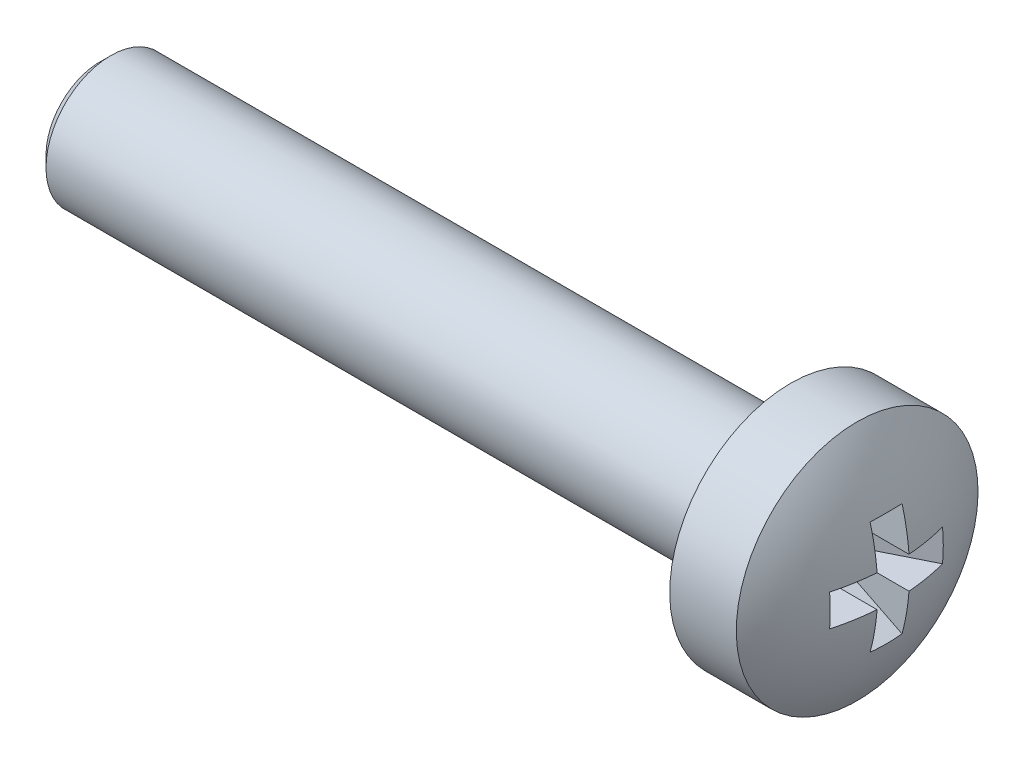
ISO-10303-21;
HEADER;
FILE_DESCRIPTION(('STEP AP214'),'2;1');
FILE_NAME('part.step','',(''),(''),'','','');
FILE_SCHEMA(('AUTOMOTIVE_DESIGN { 1 0 10303 214 1 1 1 1 }'));
ENDSEC;
DATA;
#1=APPLICATION_CONTEXT('core data for automotive mechanical design processes');
#2=APPLICATION_PROTOCOL_DEFINITION('international standard','automotive_design',2000,#1);
#3=PRODUCT_CONTEXT('',#1,'mechanical');
#4=PRODUCT('Part','Part','',(#3));
#5=PRODUCT_RELATED_PRODUCT_CATEGORY('part','',(#4));
#6=PRODUCT_DEFINITION_FORMATION('','',#4);
#7=PRODUCT_DEFINITION_CONTEXT('part definition',#1,'design');
#8=PRODUCT_DEFINITION('design','',#6,#7);
#9=PRODUCT_DEFINITION_SHAPE('','',#8);
#10=(LENGTH_UNIT() NAMED_UNIT(*) SI_UNIT(.MILLI.,.METRE.));
#11=(NAMED_UNIT(*) PLANE_ANGLE_UNIT() SI_UNIT($,.RADIAN.));
#12=(NAMED_UNIT(*) SI_UNIT($,.STERADIAN.) SOLID_ANGLE_UNIT());
#13=UNCERTAINTY_MEASURE_WITH_UNIT(LENGTH_MEASURE(1.E-05),#10,'distance_accuracy_value','');
#14=(GEOMETRIC_REPRESENTATION_CONTEXT(3) GLOBAL_UNCERTAINTY_ASSIGNED_CONTEXT((#13)) GLOBAL_UNIT_ASSIGNED_CONTEXT((#10,
#11,#12)) REPRESENTATION_CONTEXT('',''));
#15=CARTESIAN_POINT('',(0.,0.,0.));
#16=DIRECTION('',(0.,0.,1.));
#17=DIRECTION('',(1.,0.,0.));
#18=AXIS2_PLACEMENT_3D('',#15,#16,#17);
#19=CARTESIAN_POINT('',(-5.,0.,0.));
#20=DIRECTION('',(1.,0.,0.));
#21=DIRECTION('',(0.,-1.,0.));
#22=AXIS2_PLACEMENT_3D('',#19,#20,#21);
#23=SPHERICAL_SURFACE('',#22,5.);
#24=CARTESIAN_POINT('',(-4.56358241491322,0.,-0.875318258911803));
#25=DIRECTION('',(0.446197813109809,0.,-0.894934361602025));
#26=DIRECTION('',(-0.894934361602025,0.,-0.446197813109809));
#27=AXIS2_PLACEMENT_3D('',#24,#25,#26);
#28=CIRCLE('',#27,4.90340265907692);
#29=CARTESIAN_POINT('',(-0.187869730483241,0.37,1.3063316076711));
#30=VERTEX_POINT('',#29);
#31=CARTESIAN_POINT('',(-0.187869730483241,-0.37,1.3063316076711));
#32=VERTEX_POINT('',#31);
#33=EDGE_CURVE('E195',#30,#32,#28,.T.);
#34=ORIENTED_EDGE('',*,*,#33,.F.);
#35=CARTESIAN_POINT('',(-5.,0.37,0.));
#36=DIRECTION('',(0.,-1.,0.));
#37=DIRECTION('',(0.,0.,-1.));
#38=AXIS2_PLACEMENT_3D('',#35,#36,#37);
#39=CIRCLE('',#38,4.98629120689917);
#40=CARTESIAN_POINT('',(-0.0274553797879303,0.37,0.37));
#41=VERTEX_POINT('',#40);
#42=EDGE_CURVE('E114',#30,#41,#39,.F.);
#43=ORIENTED_EDGE('',*,*,#42,.T.);
#44=CARTESIAN_POINT('',(-5.,0.,0.37));
#45=DIRECTION('',(0.,0.,1.));
#46=DIRECTION('',(0.,-1.,0.));
#47=AXIS2_PLACEMENT_3D('',#44,#45,#46);
#48=CIRCLE('',#47,4.98629120689917);
#49=CARTESIAN_POINT('',(-0.187869730483241,1.3063316076711,0.37));
#50=VERTEX_POINT('',#49);
#51=EDGE_CURVE('E146',#50,#41,#48,.F.);
#52=ORIENTED_EDGE('',*,*,#51,.F.);
#53=CARTESIAN_POINT('',(-4.56358241491322,-0.875318258911803,0.));
#54=DIRECTION('',(0.446197813109809,-0.894934361602025,0.));
#55=DIRECTION('',(0.894934361602025,0.446197813109809,0.));
#56=AXIS2_PLACEMENT_3D('',#53,#54,#55);
#57=CIRCLE('',#56,4.90340265907692);
#58=CARTESIAN_POINT('',(-0.187869730483241,1.3063316076711,-0.37));
#59=VERTEX_POINT('',#58);
#60=EDGE_CURVE('E143',#50,#59,#57,.F.);
#61=ORIENTED_EDGE('',*,*,#60,.T.);
#62=CARTESIAN_POINT('',(-5.,0.,-0.37));
#63=DIRECTION('',(0.,0.,1.));
#64=DIRECTION('',(0.,-1.,0.));
#65=AXIS2_PLACEMENT_3D('',#62,#63,#64);
#66=CIRCLE('',#65,4.98629120689917);
#67=CARTESIAN_POINT('',(-0.0274553797879303,0.37,-0.37));
#68=VERTEX_POINT('',#67);
#69=EDGE_CURVE('E147',#59,#68,#66,.F.);
#70=ORIENTED_EDGE('',*,*,#69,.T.);
#71=CARTESIAN_POINT('',(-5.,0.37,0.));
#72=DIRECTION('',(0.,-1.,0.));
#73=DIRECTION('',(0.,0.,-1.));
#74=AXIS2_PLACEMENT_3D('',#71,#72,#73);
#75=CIRCLE('',#74,4.98629120689917);
#76=CARTESIAN_POINT('',(-0.187869730483241,0.37,-1.3063316076711));
#77=VERTEX_POINT('',#76);
#78=EDGE_CURVE('E197',#68,#77,#75,.F.);
#79=ORIENTED_EDGE('',*,*,#78,.T.);
#80=CARTESIAN_POINT('',(-4.56358241491322,0.,0.875318258911803));
#81=DIRECTION('',(0.446197813109809,0.,0.894934361602025));
#82=DIRECTION('',(0.894934361602025,0.,-0.446197813109809));
#83=AXIS2_PLACEMENT_3D('',#80,#81,#82);
#84=CIRCLE('',#83,4.90340265907692);
#85=CARTESIAN_POINT('',(-0.187869730483241,-0.37,-1.3063316076711));
#86=VERTEX_POINT('',#85);
#87=EDGE_CURVE('E200',#77,#86,#84,.F.);
#88=ORIENTED_EDGE('',*,*,#87,.T.);
#89=CARTESIAN_POINT('',(-5.,-0.37,0.));
#90=DIRECTION('',(0.,-1.,0.));
#91=DIRECTION('',(0.,0.,-1.));
#92=AXIS2_PLACEMENT_3D('',#89,#90,#91);
#93=CIRCLE('',#92,4.98629120689917);
#94=CARTESIAN_POINT('',(-0.0274553797879303,-0.37,-0.37));
#95=VERTEX_POINT('',#94);
#96=EDGE_CURVE('E201',#95,#86,#93,.F.);
#97=ORIENTED_EDGE('',*,*,#96,.F.);
#98=CARTESIAN_POINT('',(-5.,0.,-0.37));
#99=DIRECTION('',(0.,0.,1.));
#100=DIRECTION('',(0.,-1.,0.));
#101=AXIS2_PLACEMENT_3D('',#98,#99,#100);
#102=CIRCLE('',#101,4.98629120689917);
#103=CARTESIAN_POINT('',(-0.187869730483241,-1.3063316076711,-0.37));
#104=VERTEX_POINT('',#103);
#105=EDGE_CURVE('E157',#95,#104,#102,.F.);
#106=ORIENTED_EDGE('',*,*,#105,.T.);
#107=CARTESIAN_POINT('',(-4.56358241491322,0.875318258911802,0.));
#108=DIRECTION('',(0.446197813109809,0.894934361602025,0.));
#109=DIRECTION('',(-0.894934361602025,0.446197813109809,0.));
#110=AXIS2_PLACEMENT_3D('',#107,#108,#109);
#111=CIRCLE('',#110,4.90340265907692);
#112=CARTESIAN_POINT('',(-0.187869730483241,-1.3063316076711,0.37));
#113=VERTEX_POINT('',#112);
#114=EDGE_CURVE('E154',#113,#104,#111,.T.);
#115=ORIENTED_EDGE('',*,*,#114,.F.);
#116=CARTESIAN_POINT('',(-5.,0.,0.37));
#117=DIRECTION('',(0.,0.,1.));
#118=DIRECTION('',(0.,-1.,0.));
#119=AXIS2_PLACEMENT_3D('',#116,#117,#118);
#120=CIRCLE('',#119,4.98629120689917);
#121=CARTESIAN_POINT('',(-0.0274553797879303,-0.37,0.37));
#122=VERTEX_POINT('',#121);
#123=EDGE_CURVE('E158',#122,#113,#120,.F.);
#124=ORIENTED_EDGE('',*,*,#123,.F.);
#125=CARTESIAN_POINT('',(-5.,-0.37,0.));
#126=DIRECTION('',(0.,-1.,0.));
#127=DIRECTION('',(0.,0.,-1.));
#128=AXIS2_PLACEMENT_3D('',#125,#126,#127);
#129=CIRCLE('',#128,4.98629120689917);
#130=EDGE_CURVE('E193',#32,#122,#129,.F.);
#131=ORIENTED_EDGE('',*,*,#130,.F.);
#132=EDGE_LOOP('',(#34,#43,#52,#61,#70,#79,#88,#97,#106,#115,#124,#131));
#133=FACE_BOUND('',#132,.T.);
#134=CARTESIAN_POINT('',(-0.857536964558404,0.,0.));
#135=DIRECTION('',(1.,0.,0.));
#136=DIRECTION('',(0.,1.,0.));
#137=AXIS2_PLACEMENT_3D('',#134,#135,#136);
#138=CIRCLE('',#137,2.8);
#139=CARTESIAN_POINT('',(-0.857536964558404,2.8,0.));
#140=VERTEX_POINT('',#139);
#141=EDGE_CURVE('E118',#140,#140,#138,.T.);
#142=ORIENTED_EDGE('',*,*,#141,.T.);
#143=EDGE_LOOP('',(#142));
#144=FACE_BOUND('',#143,.T.);
#145=ADVANCED_FACE('F16',(#133,#144),#23,.T.);
#146=CARTESIAN_POINT('',(-18.4,0.,0.));
#147=DIRECTION('',(-1.,0.,0.));
#148=DIRECTION('',(0.,-1.,0.));
#149=AXIS2_PLACEMENT_3D('',#146,#147,#148);
#150=PLANE('',#149);
#151=CARTESIAN_POINT('',(-18.4,0.,0.));
#152=DIRECTION('',(-1.,0.,0.));
#153=DIRECTION('',(0.,-1.,0.));
#154=AXIS2_PLACEMENT_3D('',#151,#152,#153);
#155=CIRCLE('',#154,1.25);
#156=CARTESIAN_POINT('',(-18.4,-1.25,0.));
#157=VERTEX_POINT('',#156);
#158=EDGE_CURVE('E10',#157,#157,#155,.T.);
#159=ORIENTED_EDGE('',*,*,#158,.T.);
#160=EDGE_LOOP('',(#159));
#161=FACE_BOUND('',#160,.T.);
#162=ADVANCED_FACE('F262',(#161),#150,.T.);
#163=CARTESIAN_POINT('',(0.,0.,0.));
#164=DIRECTION('',(1.,0.,0.));
#165=DIRECTION('',(0.,1.,0.));
#166=AXIS2_PLACEMENT_3D('',#163,#164,#165);
#167=CYLINDRICAL_SURFACE('',#166,1.5);
#168=CARTESIAN_POINT('',(-18.15,0.,0.));
#169=DIRECTION('',(-1.,0.,0.));
#170=DIRECTION('',(0.,-1.,0.));
#171=AXIS2_PLACEMENT_3D('',#168,#169,#170);
#172=CIRCLE('',#171,1.5);
#173=CARTESIAN_POINT('',(-18.15,-1.5,0.));
#174=VERTEX_POINT('',#173);
#175=EDGE_CURVE('E26',#174,#174,#172,.F.);
#176=ORIENTED_EDGE('',*,*,#175,.T.);
#177=EDGE_LOOP('',(#176));
#178=FACE_BOUND('',#177,.T.);
#179=CARTESIAN_POINT('',(-2.4,0.,0.));
#180=DIRECTION('',(1.,0.,0.));
#181=DIRECTION('',(0.,1.,0.));
#182=AXIS2_PLACEMENT_3D('',#179,#180,#181);
#183=CIRCLE('',#182,1.5);
#184=CARTESIAN_POINT('',(-2.4,1.5,0.));
#185=VERTEX_POINT('',#184);
#186=EDGE_CURVE('E190',#185,#185,#183,.T.);
#187=ORIENTED_EDGE('',*,*,#186,.F.);
#188=EDGE_LOOP('',(#187));
#189=FACE_BOUND('',#188,.T.);
#190=ADVANCED_FACE('F268',(#178,#189),#167,.T.);
#191=CARTESIAN_POINT('',(-2.4,1.5,0.));
#192=DIRECTION('',(-1.,0.,0.));
#193=DIRECTION('',(0.,-1.,0.));
#194=AXIS2_PLACEMENT_3D('',#191,#192,#193);
#195=PLANE('',#194);
#196=ORIENTED_EDGE('',*,*,#186,.T.);
#197=EDGE_LOOP('',(#196));
#198=FACE_BOUND('',#197,.T.);
#199=CARTESIAN_POINT('',(-2.4,0.,0.));
#200=DIRECTION('',(1.,0.,0.));
#201=DIRECTION('',(0.,1.,0.));
#202=AXIS2_PLACEMENT_3D('',#199,#200,#201);
#203=CIRCLE('',#202,2.8);
#204=CARTESIAN_POINT('',(-2.4,2.8,0.));
#205=VERTEX_POINT('',#204);
#206=EDGE_CURVE('E187',#205,#205,#203,.T.);
#207=ORIENTED_EDGE('',*,*,#206,.F.);
#208=EDGE_LOOP('',(#207));
#209=FACE_BOUND('',#208,.T.);
#210=ADVANCED_FACE('F299',(#198,#209),#195,.T.);
#211=CARTESIAN_POINT('',(0.,0.,0.));
#212=DIRECTION('',(1.,0.,0.));
#213=DIRECTION('',(0.,1.,0.));
#214=AXIS2_PLACEMENT_3D('',#211,#212,#213);
#215=CYLINDRICAL_SURFACE('',#214,2.8);
#216=ORIENTED_EDGE('',*,*,#206,.T.);
#217=EDGE_LOOP('',(#216));
#218=FACE_BOUND('',#217,.T.);
#219=ORIENTED_EDGE('',*,*,#141,.F.);
#220=EDGE_LOOP('',(#219));
#221=FACE_BOUND('',#220,.T.);
#222=ADVANCED_FACE('F296',(#218,#221),#215,.T.);
#223=CARTESIAN_POINT('',(0.,0.,1.4));
#224=DIRECTION('',(0.446197813109809,0.,-0.894934361602025));
#225=DIRECTION('',(-0.894934361602025,0.,-0.446197813109809));
#226=AXIS2_PLACEMENT_3D('',#223,#224,#225);
#227=PLANE('',#226);
#228=ORIENTED_EDGE('',*,*,#33,.T.);
#229=DIRECTION('',(-0.894934361602025,0.,-0.446197813109809));
#230=VECTOR('',#229,1.);
#231=CARTESIAN_POINT('',(0.,-0.37,1.4));
#232=LINE('',#231,#230);
#233=CARTESIAN_POINT('',(-1.75,-0.37,0.527482185906493));
#234=VERTEX_POINT('',#233);
#235=EDGE_CURVE('E35',#234,#32,#232,.F.);
#236=ORIENTED_EDGE('',*,*,#235,.F.);
#237=DIRECTION('',(0.,1.,0.));
#238=VECTOR('',#237,1.);
#239=CARTESIAN_POINT('',(-1.75,0.,0.527482185906493));
#240=LINE('',#239,#238);
#241=CARTESIAN_POINT('',(-1.75,0.37,0.527482185906493));
#242=VERTEX_POINT('',#241);
#243=EDGE_CURVE('E126',#242,#234,#240,.F.);
#244=ORIENTED_EDGE('',*,*,#243,.F.);
#245=DIRECTION('',(-0.894934361602025,0.,-0.446197813109809));
#246=VECTOR('',#245,1.);
#247=CARTESIAN_POINT('',(0.,0.37,1.4));
#248=LINE('',#247,#246);
#249=EDGE_CURVE('E107',#242,#30,#248,.F.);
#250=ORIENTED_EDGE('',*,*,#249,.T.);
#251=EDGE_LOOP('',(#228,#236,#244,#250));
#252=FACE_BOUND('',#251,.T.);
#253=ADVANCED_FACE('F18',(#252),#227,.T.);
#254=CARTESIAN_POINT('',(-1.75,0.37,0.));
#255=DIRECTION('',(0.,-1.,0.));
#256=DIRECTION('',(0.,0.,-1.));
#257=AXIS2_PLACEMENT_3D('',#254,#255,#256);
#258=PLANE('',#257);
#259=ORIENTED_EDGE('',*,*,#249,.F.);
#260=DIRECTION('',(0.,0.,-1.));
#261=VECTOR('',#260,1.);
#262=CARTESIAN_POINT('',(-1.75,0.37,0.));
#263=LINE('',#262,#261);
#264=CARTESIAN_POINT('',(-1.75,0.37,0.37));
#265=VERTEX_POINT('',#264);
#266=EDGE_CURVE('E111',#242,#265,#263,.T.);
#267=ORIENTED_EDGE('',*,*,#266,.T.);
#268=DIRECTION('',(1.,0.,0.));
#269=VECTOR('',#268,1.);
#270=CARTESIAN_POINT('',(-1.75,0.37,0.37));
#271=LINE('',#270,#269);
#272=EDGE_CURVE('E119',#265,#41,#271,.T.);
#273=ORIENTED_EDGE('',*,*,#272,.T.);
#274=ORIENTED_EDGE('',*,*,#42,.F.);
#275=EDGE_LOOP('',(#259,#267,#273,#274));
#276=FACE_BOUND('',#275,.T.);
#277=ADVANCED_FACE('F109',(#276),#258,.T.);
#278=CARTESIAN_POINT('',(-1.75,0.,0.37));
#279=DIRECTION('',(0.,0.,1.));
#280=DIRECTION('',(0.,-1.,0.));
#281=AXIS2_PLACEMENT_3D('',#278,#279,#280);
#282=PLANE('',#281);
#283=ORIENTED_EDGE('',*,*,#51,.T.);
#284=ORIENTED_EDGE('',*,*,#272,.F.);
#285=DIRECTION('',(0.,-1.,0.));
#286=VECTOR('',#285,1.);
#287=CARTESIAN_POINT('',(-1.75,0.,0.37));
#288=LINE('',#287,#286);
#289=CARTESIAN_POINT('',(-1.75,0.527482185906492,0.37));
#290=VERTEX_POINT('',#289);
#291=EDGE_CURVE('E129',#290,#265,#288,.T.);
#292=ORIENTED_EDGE('',*,*,#291,.F.);
#293=DIRECTION('',(0.894934361602025,0.446197813109809,0.));
#294=VECTOR('',#293,1.);
#295=CARTESIAN_POINT('',(-1.96063300229114,0.42246444491505,0.37));
#296=LINE('',#295,#294);
#297=EDGE_CURVE('E139',#290,#50,#296,.T.);
#298=ORIENTED_EDGE('',*,*,#297,.T.);
#299=EDGE_LOOP('',(#283,#284,#292,#298));
#300=FACE_BOUND('',#299,.T.);
#301=ADVANCED_FACE('F250',(#300),#282,.F.);
#302=CARTESIAN_POINT('',(0.,1.4,0.));
#303=DIRECTION('',(0.446197813109809,-0.894934361602025,0.));
#304=DIRECTION('',(0.894934361602025,0.446197813109809,0.));
#305=AXIS2_PLACEMENT_3D('',#302,#303,#304);
#306=PLANE('',#305);
#307=ORIENTED_EDGE('',*,*,#297,.F.);
#308=DIRECTION('',(0.,0.,-1.));
#309=VECTOR('',#308,1.);
#310=CARTESIAN_POINT('',(-1.75,0.527482185906492,0.));
#311=LINE('',#310,#309);
#312=CARTESIAN_POINT('',(-1.75,0.527482185906492,-0.37));
#313=VERTEX_POINT('',#312);
#314=EDGE_CURVE('E151',#290,#313,#311,.T.);
#315=ORIENTED_EDGE('',*,*,#314,.T.);
#316=DIRECTION('',(0.894934361602025,0.446197813109809,0.));
#317=VECTOR('',#316,1.);
#318=CARTESIAN_POINT('',(-1.96063300229114,0.42246444491505,-0.37));
#319=LINE('',#318,#317);
#320=EDGE_CURVE('E142',#313,#59,#319,.T.);
#321=ORIENTED_EDGE('',*,*,#320,.T.);
#322=ORIENTED_EDGE('',*,*,#60,.F.);
#323=EDGE_LOOP('',(#307,#315,#321,#322));
#324=FACE_BOUND('',#323,.T.);
#325=ADVANCED_FACE('F248',(#324),#306,.T.);
#326=CARTESIAN_POINT('',(-1.75,0.,-0.37));
#327=DIRECTION('',(0.,0.,1.));
#328=DIRECTION('',(0.,-1.,0.));
#329=AXIS2_PLACEMENT_3D('',#326,#327,#328);
#330=PLANE('',#329);
#331=ORIENTED_EDGE('',*,*,#320,.F.);
#332=DIRECTION('',(0.,-1.,0.));
#333=VECTOR('',#332,1.);
#334=CARTESIAN_POINT('',(-1.75,0.,-0.37));
#335=LINE('',#334,#333);
#336=CARTESIAN_POINT('',(-1.75,0.37,-0.37));
#337=VERTEX_POINT('',#336);
#338=EDGE_CURVE('E153',#313,#337,#335,.T.);
#339=ORIENTED_EDGE('',*,*,#338,.T.);
#340=DIRECTION('',(1.,0.,0.));
#341=VECTOR('',#340,1.);
#342=CARTESIAN_POINT('',(-1.75,0.37,-0.37));
#343=LINE('',#342,#341);
#344=EDGE_CURVE('E150',#337,#68,#343,.T.);
#345=ORIENTED_EDGE('',*,*,#344,.T.);
#346=ORIENTED_EDGE('',*,*,#69,.F.);
#347=EDGE_LOOP('',(#331,#339,#345,#346));
#348=FACE_BOUND('',#347,.T.);
#349=ADVANCED_FACE('F245',(#348),#330,.T.);
#350=CARTESIAN_POINT('',(-1.75,0.37,0.));
#351=DIRECTION('',(0.,-1.,0.));
#352=DIRECTION('',(0.,0.,-1.));
#353=AXIS2_PLACEMENT_3D('',#350,#351,#352);
#354=PLANE('',#353);
#355=ORIENTED_EDGE('',*,*,#344,.F.);
#356=DIRECTION('',(0.,0.,-1.));
#357=VECTOR('',#356,1.);
#358=CARTESIAN_POINT('',(-1.75,0.37,0.));
#359=LINE('',#358,#357);
#360=CARTESIAN_POINT('',(-1.75,0.37,-0.527482185906493));
#361=VERTEX_POINT('',#360);
#362=EDGE_CURVE('E173',#337,#361,#359,.T.);
#363=ORIENTED_EDGE('',*,*,#362,.T.);
#364=DIRECTION('',(0.894934361602025,0.,-0.446197813109809));
#365=VECTOR('',#364,1.);
#366=CARTESIAN_POINT('',(0.,0.37,-1.4));
#367=LINE('',#366,#365);
#368=EDGE_CURVE('E180',#361,#77,#367,.T.);
#369=ORIENTED_EDGE('',*,*,#368,.T.);
#370=ORIENTED_EDGE('',*,*,#78,.F.);
#371=EDGE_LOOP('',(#355,#363,#369,#370));
#372=FACE_BOUND('',#371,.T.);
#373=ADVANCED_FACE('F242',(#372),#354,.T.);
#374=CARTESIAN_POINT('',(0.,0.,-1.4));
#375=DIRECTION('',(0.446197813109809,0.,0.894934361602025));
#376=DIRECTION('',(0.894934361602025,0.,-0.446197813109809));
#377=AXIS2_PLACEMENT_3D('',#374,#375,#376);
#378=PLANE('',#377);
#379=ORIENTED_EDGE('',*,*,#368,.F.);
#380=DIRECTION('',(0.,-1.,0.));
#381=VECTOR('',#380,1.);
#382=CARTESIAN_POINT('',(-1.75,0.,-0.527482185906493));
#383=LINE('',#382,#381);
#384=CARTESIAN_POINT('',(-1.75,-0.37,-0.527482185906493));
#385=VERTEX_POINT('',#384);
#386=EDGE_CURVE('E172',#361,#385,#383,.T.);
#387=ORIENTED_EDGE('',*,*,#386,.T.);
#388=DIRECTION('',(0.894934361602025,0.,-0.446197813109809));
#389=VECTOR('',#388,1.);
#390=CARTESIAN_POINT('',(0.,-0.37,-1.4));
#391=LINE('',#390,#389);
#392=EDGE_CURVE('E182',#385,#86,#391,.T.);
#393=ORIENTED_EDGE('',*,*,#392,.T.);
#394=ORIENTED_EDGE('',*,*,#87,.F.);
#395=EDGE_LOOP('',(#379,#387,#393,#394));
#396=FACE_BOUND('',#395,.T.);
#397=ADVANCED_FACE('F236',(#396),#378,.T.);
#398=CARTESIAN_POINT('',(-1.75,-0.37,0.));
#399=DIRECTION('',(0.,-1.,0.));
#400=DIRECTION('',(0.,0.,-1.));
#401=AXIS2_PLACEMENT_3D('',#398,#399,#400);
#402=PLANE('',#401);
#403=ORIENTED_EDGE('',*,*,#96,.T.);
#404=ORIENTED_EDGE('',*,*,#392,.F.);
#405=DIRECTION('',(0.,0.,-1.));
#406=VECTOR('',#405,1.);
#407=CARTESIAN_POINT('',(-1.75,-0.37,0.));
#408=LINE('',#407,#406);
#409=CARTESIAN_POINT('',(-1.75,-0.37,-0.37));
#410=VERTEX_POINT('',#409);
#411=EDGE_CURVE('E165',#410,#385,#408,.T.);
#412=ORIENTED_EDGE('',*,*,#411,.F.);
#413=DIRECTION('',(1.,0.,0.));
#414=VECTOR('',#413,1.);
#415=CARTESIAN_POINT('',(-1.75,-0.37,-0.37));
#416=LINE('',#415,#414);
#417=EDGE_CURVE('E79',#410,#95,#416,.T.);
#418=ORIENTED_EDGE('',*,*,#417,.T.);
#419=EDGE_LOOP('',(#403,#404,#412,#418));
#420=FACE_BOUND('',#419,.T.);
#421=ADVANCED_FACE('F232',(#420),#402,.F.);
#422=CARTESIAN_POINT('',(-1.75,0.,-0.37));
#423=DIRECTION('',(0.,0.,1.));
#424=DIRECTION('',(0.,-1.,0.));
#425=AXIS2_PLACEMENT_3D('',#422,#423,#424);
#426=PLANE('',#425);
#427=ORIENTED_EDGE('',*,*,#417,.F.);
#428=DIRECTION('',(0.,-1.,0.));
#429=VECTOR('',#428,1.);
#430=CARTESIAN_POINT('',(-1.75,0.,-0.37));
#431=LINE('',#430,#429);
#432=CARTESIAN_POINT('',(-1.75,-0.527482185906493,-0.37));
#433=VERTEX_POINT('',#432);
#434=EDGE_CURVE('E73',#410,#433,#431,.T.);
#435=ORIENTED_EDGE('',*,*,#434,.T.);
#436=DIRECTION('',(-0.894934361602025,0.446197813109809,0.));
#437=VECTOR('',#436,1.);
#438=CARTESIAN_POINT('',(-1.96063300229114,-0.42246444491505,-0.37));
#439=LINE('',#438,#437);
#440=EDGE_CURVE('E20',#433,#104,#439,.F.);
#441=ORIENTED_EDGE('',*,*,#440,.T.);
#442=ORIENTED_EDGE('',*,*,#105,.F.);
#443=EDGE_LOOP('',(#427,#435,#441,#442));
#444=FACE_BOUND('',#443,.T.);
#445=ADVANCED_FACE('F228',(#444),#426,.T.);
#446=CARTESIAN_POINT('',(0.,-1.4,0.));
#447=DIRECTION('',(0.446197813109809,0.894934361602025,0.));
#448=DIRECTION('',(-0.894934361602025,0.446197813109809,0.));
#449=AXIS2_PLACEMENT_3D('',#446,#447,#448);
#450=PLANE('',#449);
#451=ORIENTED_EDGE('',*,*,#114,.T.);
#452=ORIENTED_EDGE('',*,*,#440,.F.);
#453=DIRECTION('',(0.,0.,1.));
#454=VECTOR('',#453,1.);
#455=CARTESIAN_POINT('',(-1.75,-0.527482185906493,0.));
#456=LINE('',#455,#454);
#457=CARTESIAN_POINT('',(-1.75,-0.527482185906493,0.37));
#458=VERTEX_POINT('',#457);
#459=EDGE_CURVE('E161',#458,#433,#456,.F.);
#460=ORIENTED_EDGE('',*,*,#459,.F.);
#461=DIRECTION('',(-0.894934361602025,0.446197813109809,0.));
#462=VECTOR('',#461,1.);
#463=CARTESIAN_POINT('',(-1.96063300229114,-0.42246444491505,0.37));
#464=LINE('',#463,#462);
#465=EDGE_CURVE('E159',#458,#113,#464,.F.);
#466=ORIENTED_EDGE('',*,*,#465,.T.);
#467=EDGE_LOOP('',(#451,#452,#460,#466));
#468=FACE_BOUND('',#467,.T.);
#469=ADVANCED_FACE('F227',(#468),#450,.T.);
#470=CARTESIAN_POINT('',(-1.75,0.,0.37));
#471=DIRECTION('',(0.,0.,1.));
#472=DIRECTION('',(0.,-1.,0.));
#473=AXIS2_PLACEMENT_3D('',#470,#471,#472);
#474=PLANE('',#473);
#475=ORIENTED_EDGE('',*,*,#123,.T.);
#476=ORIENTED_EDGE('',*,*,#465,.F.);
#477=DIRECTION('',(0.,-1.,0.));
#478=VECTOR('',#477,1.);
#479=CARTESIAN_POINT('',(-1.75,0.,0.37));
#480=LINE('',#479,#478);
#481=CARTESIAN_POINT('',(-1.75,-0.37,0.37));
#482=VERTEX_POINT('',#481);
#483=EDGE_CURVE('E133',#482,#458,#480,.T.);
#484=ORIENTED_EDGE('',*,*,#483,.F.);
#485=DIRECTION('',(1.,0.,0.));
#486=VECTOR('',#485,1.);
#487=CARTESIAN_POINT('',(-1.75,-0.37,0.37));
#488=LINE('',#487,#486);
#489=EDGE_CURVE('E138',#482,#122,#488,.T.);
#490=ORIENTED_EDGE('',*,*,#489,.T.);
#491=EDGE_LOOP('',(#475,#476,#484,#490));
#492=FACE_BOUND('',#491,.T.);
#493=ADVANCED_FACE('F225',(#492),#474,.F.);
#494=CARTESIAN_POINT('',(-1.75,-0.37,0.));
#495=DIRECTION('',(0.,-1.,0.));
#496=DIRECTION('',(0.,0.,-1.));
#497=AXIS2_PLACEMENT_3D('',#494,#495,#496);
#498=PLANE('',#497);
#499=ORIENTED_EDGE('',*,*,#130,.T.);
#500=ORIENTED_EDGE('',*,*,#489,.F.);
#501=DIRECTION('',(0.,0.,-1.));
#502=VECTOR('',#501,1.);
#503=CARTESIAN_POINT('',(-1.75,-0.37,0.));
#504=LINE('',#503,#502);
#505=EDGE_CURVE('E131',#234,#482,#504,.T.);
#506=ORIENTED_EDGE('',*,*,#505,.F.);
#507=ORIENTED_EDGE('',*,*,#235,.T.);
#508=EDGE_LOOP('',(#499,#500,#506,#507));
#509=FACE_BOUND('',#508,.T.);
#510=ADVANCED_FACE('F223',(#509),#498,.F.);
#511=CARTESIAN_POINT('',(-1.75,0.,0.));
#512=DIRECTION('',(1.,0.,0.));
#513=DIRECTION('',(0.,0.,-1.));
#514=AXIS2_PLACEMENT_3D('',#511,#512,#513);
#515=PLANE('',#514);
#516=ORIENTED_EDGE('',*,*,#243,.T.);
#517=ORIENTED_EDGE('',*,*,#505,.T.);
#518=ORIENTED_EDGE('',*,*,#483,.T.);
#519=ORIENTED_EDGE('',*,*,#459,.T.);
#520=ORIENTED_EDGE('',*,*,#434,.F.);
#521=ORIENTED_EDGE('',*,*,#411,.T.);
#522=ORIENTED_EDGE('',*,*,#386,.F.);
#523=ORIENTED_EDGE('',*,*,#362,.F.);
#524=ORIENTED_EDGE('',*,*,#338,.F.);
#525=ORIENTED_EDGE('',*,*,#314,.F.);
#526=ORIENTED_EDGE('',*,*,#291,.T.);
#527=ORIENTED_EDGE('',*,*,#266,.F.);
#528=EDGE_LOOP('',(#516,#517,#518,#519,#520,#521,#522,#523,#524,#525,#526,#527));
#529=FACE_BOUND('',#528,.T.);
#530=ADVANCED_FACE('F124',(#529),#515,.T.);
#531=CARTESIAN_POINT('',(-18.15,0.,0.));
#532=DIRECTION('',(1.,0.,0.));
#533=DIRECTION('',(0.,1.,0.));
#534=AXIS2_PLACEMENT_3D('',#531,#532,#533);
#535=CONICAL_SURFACE('',#534,1.5,0.785398163397446);
#536=ORIENTED_EDGE('',*,*,#158,.F.);
#537=EDGE_LOOP('',(#536));
#538=FACE_BOUND('',#537,.T.);
#539=ORIENTED_EDGE('',*,*,#175,.F.);
#540=EDGE_LOOP('',(#539));
#541=FACE_BOUND('',#540,.T.);
#542=ADVANCED_FACE('F273',(#538,#541),#535,.T.);
#543=CLOSED_SHELL('',(#145,#162,#190,#210,#222,#253,#277,#301,#325,#349,#373,#397,#421,#445,
#469,#493,#510,#530,#542));
#544=MANIFOLD_SOLID_BREP('B1',#543);
#545=ADVANCED_BREP_SHAPE_REPRESENTATION('',(#18,#544),#14);
#546=SHAPE_DEFINITION_REPRESENTATION(#9,#545);
ENDSEC;
END-ISO-10303-21;
